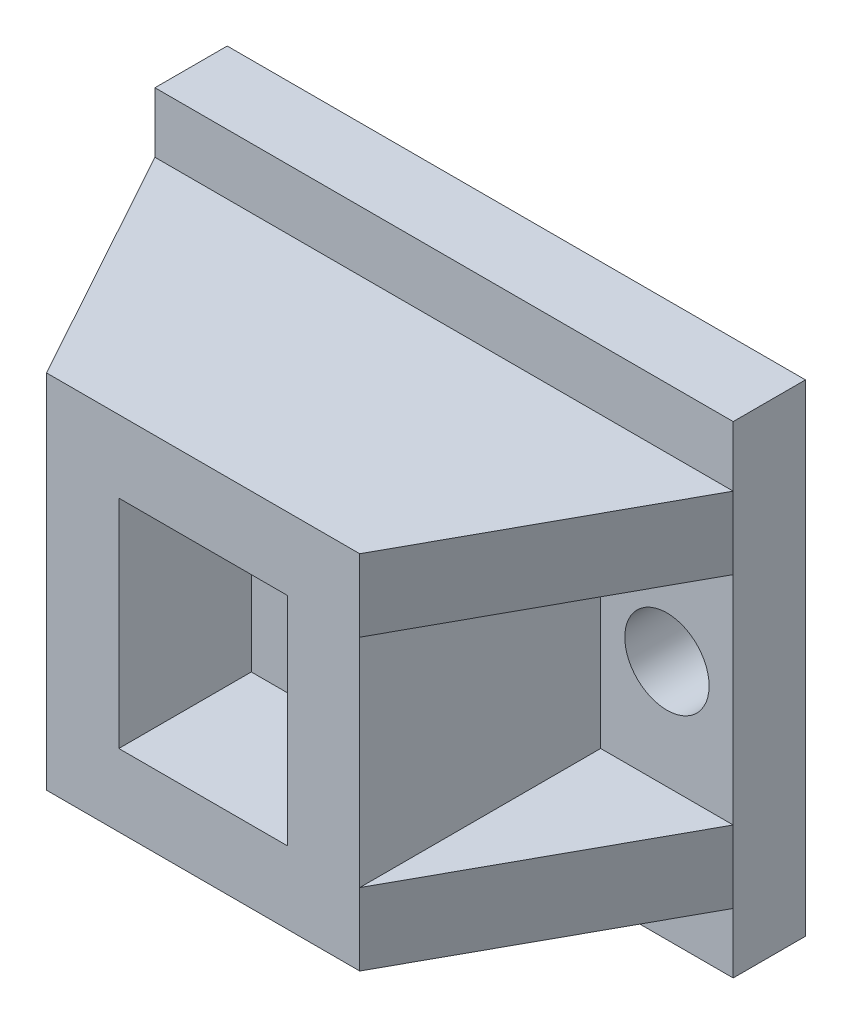
ISO-10303-21;
HEADER;
FILE_DESCRIPTION(('STEP AP214'),'2;1');
FILE_NAME('part.step','',(''),(''),'','','');
FILE_SCHEMA(('AUTOMOTIVE_DESIGN { 1 0 10303 214 1 1 1 1 }'));
ENDSEC;
DATA;
#1=APPLICATION_CONTEXT('core data for automotive mechanical design processes');
#2=APPLICATION_PROTOCOL_DEFINITION('international standard','automotive_design',2000,#1);
#3=PRODUCT_CONTEXT('',#1,'mechanical');
#4=PRODUCT('Part','Part','',(#3));
#5=PRODUCT_RELATED_PRODUCT_CATEGORY('part','',(#4));
#6=PRODUCT_DEFINITION_FORMATION('','',#4);
#7=PRODUCT_DEFINITION_CONTEXT('part definition',#1,'design');
#8=PRODUCT_DEFINITION('design','',#6,#7);
#9=PRODUCT_DEFINITION_SHAPE('','',#8);
#10=(LENGTH_UNIT() NAMED_UNIT(*) SI_UNIT(.MILLI.,.METRE.));
#11=(NAMED_UNIT(*) PLANE_ANGLE_UNIT() SI_UNIT($,.RADIAN.));
#12=(NAMED_UNIT(*) SI_UNIT($,.STERADIAN.) SOLID_ANGLE_UNIT());
#13=UNCERTAINTY_MEASURE_WITH_UNIT(LENGTH_MEASURE(1.E-05),#10,'distance_accuracy_value','');
#14=(GEOMETRIC_REPRESENTATION_CONTEXT(3) GLOBAL_UNCERTAINTY_ASSIGNED_CONTEXT((#13)) GLOBAL_UNIT_ASSIGNED_CONTEXT((#10,
#11,#12)) REPRESENTATION_CONTEXT('',''));
#15=CARTESIAN_POINT('',(0.,0.,0.));
#16=DIRECTION('',(0.,0.,1.));
#17=DIRECTION('',(1.,0.,0.));
#18=AXIS2_PLACEMENT_3D('',#15,#16,#17);
#19=CARTESIAN_POINT('',(0.,0.,3.));
#20=DIRECTION('',(0.,0.,1.));
#21=DIRECTION('',(1.,0.,0.));
#22=AXIS2_PLACEMENT_3D('',#19,#20,#21);
#23=PLANE('',#22);
#24=CARTESIAN_POINT('',(9.25,0.,3.));
#25=DIRECTION('',(0.,0.,1.));
#26=DIRECTION('',(1.,0.,0.));
#27=AXIS2_PLACEMENT_3D('',#24,#25,#26);
#28=CIRCLE('',#27,1.75);
#29=CARTESIAN_POINT('',(11.,0.,3.));
#30=VERTEX_POINT('',#29);
#31=EDGE_CURVE('E273',#30,#30,#28,.T.);
#32=ORIENTED_EDGE('',*,*,#31,.F.);
#33=EDGE_LOOP('',(#32));
#34=FACE_BOUND('',#33,.T.);
#35=DIRECTION('',(0.,-1.,0.));
#36=VECTOR('',#35,1.);
#37=CARTESIAN_POINT('',(12.,0.,3.));
#38=LINE('',#37,#36);
#39=CARTESIAN_POINT('',(12.,4.5,3.));
#40=VERTEX_POINT('',#39);
#41=CARTESIAN_POINT('',(12.,-4.5,3.));
#42=VERTEX_POINT('',#41);
#43=EDGE_CURVE('E285',#40,#42,#38,.T.);
#44=ORIENTED_EDGE('',*,*,#43,.F.);
#45=DIRECTION('',(-1.,0.,0.));
#46=VECTOR('',#45,1.);
#47=CARTESIAN_POINT('',(0.,4.5,3.));
#48=LINE('',#47,#46);
#49=CARTESIAN_POINT('',(6.5,4.5,3.));
#50=VERTEX_POINT('',#49);
#51=EDGE_CURVE('E197',#40,#50,#48,.T.);
#52=ORIENTED_EDGE('',*,*,#51,.T.);
#53=DIRECTION('',(0.,-1.,0.));
#54=VECTOR('',#53,1.);
#55=CARTESIAN_POINT('',(6.5,0.,3.));
#56=LINE('',#55,#54);
#57=CARTESIAN_POINT('',(6.5,-4.5,3.));
#58=VERTEX_POINT('',#57);
#59=EDGE_CURVE('E300',#50,#58,#56,.T.);
#60=ORIENTED_EDGE('',*,*,#59,.T.);
#61=DIRECTION('',(1.,0.,0.));
#62=VECTOR('',#61,1.);
#63=CARTESIAN_POINT('',(0.,-4.5,3.));
#64=LINE('',#63,#62);
#65=EDGE_CURVE('E211',#58,#42,#64,.T.);
#66=ORIENTED_EDGE('',*,*,#65,.T.);
#67=EDGE_LOOP('',(#44,#52,#60,#66));
#68=FACE_BOUND('',#67,.T.);
#69=ADVANCED_FACE('F39',(#34,#68),#23,.T.);
#70=CARTESIAN_POINT('',(6.5,0.,13.));
#71=DIRECTION('',(1.,0.,0.));
#72=DIRECTION('',(0.,1.,0.));
#73=AXIS2_PLACEMENT_3D('',#70,#71,#72);
#74=PLANE('',#73);
#75=ORIENTED_EDGE('',*,*,#59,.F.);
#76=DIRECTION('',(0.,0.,1.));
#77=VECTOR('',#76,1.);
#78=CARTESIAN_POINT('',(6.5,4.5,13.));
#79=LINE('',#78,#77);
#80=CARTESIAN_POINT('',(6.5,4.5,13.));
#81=VERTEX_POINT('',#80);
#82=EDGE_CURVE('E192',#50,#81,#79,.T.);
#83=ORIENTED_EDGE('',*,*,#82,.T.);
#84=DIRECTION('',(0.,-1.,0.));
#85=VECTOR('',#84,1.);
#86=CARTESIAN_POINT('',(6.5,0.,13.));
#87=LINE('',#86,#85);
#88=CARTESIAN_POINT('',(6.5,-4.5,13.));
#89=VERTEX_POINT('',#88);
#90=EDGE_CURVE('E260',#81,#89,#87,.T.);
#91=ORIENTED_EDGE('',*,*,#90,.T.);
#92=DIRECTION('',(0.,0.,-1.));
#93=VECTOR('',#92,1.);
#94=CARTESIAN_POINT('',(6.5,-4.5,13.));
#95=LINE('',#94,#93);
#96=EDGE_CURVE('E206',#89,#58,#95,.T.);
#97=ORIENTED_EDGE('',*,*,#96,.T.);
#98=EDGE_LOOP('',(#75,#83,#91,#97));
#99=FACE_BOUND('',#98,.T.);
#100=ADVANCED_FACE('F394',(#99),#74,.T.);
#101=DIRECTION('',(1.,0.,0.));
#102=VECTOR('',#101,1.);
#103=CARTESIAN_POINT('',(0.,7.5,3.));
#104=LINE('',#103,#102);
#105=CARTESIAN_POINT('',(-12.,7.5,3.));
#106=VERTEX_POINT('',#105);
#107=CARTESIAN_POINT('',(12.,7.5,3.));
#108=VERTEX_POINT('',#107);
#109=EDGE_CURVE('E298',#106,#108,#104,.T.);
#110=ORIENTED_EDGE('',*,*,#109,.T.);
#111=CARTESIAN_POINT('',(12.,10.,3.));
#112=VERTEX_POINT('',#111);
#113=EDGE_CURVE('E281',#112,#108,#38,.T.);
#114=ORIENTED_EDGE('',*,*,#113,.F.);
#115=DIRECTION('',(1.,0.,0.));
#116=VECTOR('',#115,1.);
#117=CARTESIAN_POINT('',(0.,10.,3.));
#118=LINE('',#117,#116);
#119=CARTESIAN_POINT('',(-12.,10.,3.));
#120=VERTEX_POINT('',#119);
#121=EDGE_CURVE('E284',#120,#112,#118,.T.);
#122=ORIENTED_EDGE('',*,*,#121,.F.);
#123=DIRECTION('',(0.,-1.,0.));
#124=VECTOR('',#123,1.);
#125=CARTESIAN_POINT('',(-12.,0.,3.));
#126=LINE('',#125,#124);
#127=EDGE_CURVE('E289',#120,#106,#126,.T.);
#128=ORIENTED_EDGE('',*,*,#127,.T.);
#129=EDGE_LOOP('',(#110,#114,#122,#128));
#130=FACE_BOUND('',#129,.T.);
#131=ADVANCED_FACE('F377',(#130),#23,.T.);
#132=CARTESIAN_POINT('',(-6.5,0.,13.));
#133=DIRECTION('',(1.,0.,0.));
#134=DIRECTION('',(0.,1.,0.));
#135=AXIS2_PLACEMENT_3D('',#132,#133,#134);
#136=PLANE('',#135);
#137=DIRECTION('',(0.,0.,1.));
#138=VECTOR('',#137,1.);
#139=CARTESIAN_POINT('',(-6.5,4.5,13.));
#140=LINE('',#139,#138);
#141=CARTESIAN_POINT('',(-6.5,4.5,3.));
#142=VERTEX_POINT('',#141);
#143=CARTESIAN_POINT('',(-6.5,4.5,13.));
#144=VERTEX_POINT('',#143);
#145=EDGE_CURVE('E221',#142,#144,#140,.T.);
#146=ORIENTED_EDGE('',*,*,#145,.F.);
#147=DIRECTION('',(0.,-1.,0.));
#148=VECTOR('',#147,1.);
#149=CARTESIAN_POINT('',(-6.5,0.,3.));
#150=LINE('',#149,#148);
#151=CARTESIAN_POINT('',(-6.5,-4.5,3.));
#152=VERTEX_POINT('',#151);
#153=EDGE_CURVE('E296',#142,#152,#150,.T.);
#154=ORIENTED_EDGE('',*,*,#153,.T.);
#155=DIRECTION('',(0.,0.,-1.));
#156=VECTOR('',#155,1.);
#157=CARTESIAN_POINT('',(-6.5,-4.5,13.));
#158=LINE('',#157,#156);
#159=CARTESIAN_POINT('',(-6.5,-4.5,13.));
#160=VERTEX_POINT('',#159);
#161=EDGE_CURVE('E235',#160,#152,#158,.T.);
#162=ORIENTED_EDGE('',*,*,#161,.F.);
#163=DIRECTION('',(0.,-1.,0.));
#164=VECTOR('',#163,1.);
#165=CARTESIAN_POINT('',(-6.5,0.,13.));
#166=LINE('',#165,#164);
#167=EDGE_CURVE('E253',#144,#160,#166,.T.);
#168=ORIENTED_EDGE('',*,*,#167,.F.);
#169=EDGE_LOOP('',(#146,#154,#162,#168));
#170=FACE_BOUND('',#169,.T.);
#171=ADVANCED_FACE('F370',(#170),#136,.F.);
#172=CARTESIAN_POINT('',(-9.25,0.,3.));
#173=DIRECTION('',(0.,0.,1.));
#174=DIRECTION('',(1.,0.,0.));
#175=AXIS2_PLACEMENT_3D('',#172,#173,#174);
#176=CIRCLE('',#175,1.75);
#177=CARTESIAN_POINT('',(-7.5,0.,3.));
#178=VERTEX_POINT('',#177);
#179=EDGE_CURVE('E276',#178,#178,#176,.T.);
#180=ORIENTED_EDGE('',*,*,#179,.F.);
#181=EDGE_LOOP('',(#180));
#182=FACE_BOUND('',#181,.T.);
#183=ORIENTED_EDGE('',*,*,#153,.F.);
#184=DIRECTION('',(-1.,0.,0.));
#185=VECTOR('',#184,1.);
#186=CARTESIAN_POINT('',(0.,4.5,3.));
#187=LINE('',#186,#185);
#188=CARTESIAN_POINT('',(-12.,4.5,3.));
#189=VERTEX_POINT('',#188);
#190=EDGE_CURVE('E224',#142,#189,#187,.T.);
#191=ORIENTED_EDGE('',*,*,#190,.T.);
#192=CARTESIAN_POINT('',(-12.,-4.5,3.));
#193=VERTEX_POINT('',#192);
#194=EDGE_CURVE('E293',#189,#193,#126,.T.);
#195=ORIENTED_EDGE('',*,*,#194,.T.);
#196=DIRECTION('',(1.,0.,0.));
#197=VECTOR('',#196,1.);
#198=CARTESIAN_POINT('',(0.,-4.5,3.));
#199=LINE('',#198,#197);
#200=EDGE_CURVE('E240',#193,#152,#199,.T.);
#201=ORIENTED_EDGE('',*,*,#200,.T.);
#202=EDGE_LOOP('',(#183,#191,#195,#201));
#203=FACE_BOUND('',#202,.T.);
#204=ADVANCED_FACE('F354',(#182,#203),#23,.T.);
#205=CARTESIAN_POINT('',(12.,0.,3.));
#206=DIRECTION('',(1.,0.,0.));
#207=DIRECTION('',(0.,0.,-1.));
#208=AXIS2_PLACEMENT_3D('',#205,#206,#207);
#209=PLANE('',#208);
#210=ORIENTED_EDGE('',*,*,#113,.T.);
#211=DIRECTION('',(0.,-1.,0.));
#212=VECTOR('',#211,1.);
#213=CARTESIAN_POINT('',(12.,0.,3.));
#214=LINE('',#213,#212);
#215=EDGE_CURVE('E199',#108,#40,#214,.T.);
#216=ORIENTED_EDGE('',*,*,#215,.T.);
#217=ORIENTED_EDGE('',*,*,#43,.T.);
#218=DIRECTION('',(0.,-1.,0.));
#219=VECTOR('',#218,1.);
#220=CARTESIAN_POINT('',(12.,0.,3.));
#221=LINE('',#220,#219);
#222=CARTESIAN_POINT('',(12.,-7.5,3.));
#223=VERTEX_POINT('',#222);
#224=EDGE_CURVE('E214',#223,#42,#221,.F.);
#225=ORIENTED_EDGE('',*,*,#224,.F.);
#226=CARTESIAN_POINT('',(12.,-10.,3.));
#227=VERTEX_POINT('',#226);
#228=EDGE_CURVE('E280',#223,#227,#38,.T.);
#229=ORIENTED_EDGE('',*,*,#228,.T.);
#230=DIRECTION('',(0.,0.,-1.));
#231=VECTOR('',#230,1.);
#232=CARTESIAN_POINT('',(12.,-10.,3.));
#233=LINE('',#232,#231);
#234=CARTESIAN_POINT('',(12.,-10.,0.));
#235=VERTEX_POINT('',#234);
#236=EDGE_CURVE('E304',#227,#235,#233,.T.);
#237=ORIENTED_EDGE('',*,*,#236,.T.);
#238=DIRECTION('',(0.,-1.,0.));
#239=VECTOR('',#238,1.);
#240=CARTESIAN_POINT('',(12.,0.,0.));
#241=LINE('',#240,#239);
#242=CARTESIAN_POINT('',(12.,10.,0.));
#243=VERTEX_POINT('',#242);
#244=EDGE_CURVE('E310',#243,#235,#241,.T.);
#245=ORIENTED_EDGE('',*,*,#244,.F.);
#246=DIRECTION('',(0.,0.,-1.));
#247=VECTOR('',#246,1.);
#248=CARTESIAN_POINT('',(12.,10.,3.));
#249=LINE('',#248,#247);
#250=EDGE_CURVE('E11',#112,#243,#249,.T.);
#251=ORIENTED_EDGE('',*,*,#250,.F.);
#252=EDGE_LOOP('',(#210,#216,#217,#225,#229,#237,#245,#251));
#253=FACE_BOUND('',#252,.T.);
#254=ADVANCED_FACE('F340',(#253),#209,.T.);
#255=CARTESIAN_POINT('',(0.,10.,3.));
#256=DIRECTION('',(0.,1.,0.));
#257=DIRECTION('',(0.,0.,1.));
#258=AXIS2_PLACEMENT_3D('',#255,#256,#257);
#259=PLANE('',#258);
#260=DIRECTION('',(1.,0.,0.));
#261=VECTOR('',#260,1.);
#262=CARTESIAN_POINT('',(0.,10.,0.));
#263=LINE('',#262,#261);
#264=CARTESIAN_POINT('',(-12.,10.,0.));
#265=VERTEX_POINT('',#264);
#266=EDGE_CURVE('E312',#265,#243,#263,.T.);
#267=ORIENTED_EDGE('',*,*,#266,.F.);
#268=DIRECTION('',(0.,0.,-1.));
#269=VECTOR('',#268,1.);
#270=CARTESIAN_POINT('',(-12.,10.,3.));
#271=LINE('',#270,#269);
#272=EDGE_CURVE('E47',#120,#265,#271,.T.);
#273=ORIENTED_EDGE('',*,*,#272,.F.);
#274=ORIENTED_EDGE('',*,*,#121,.T.);
#275=ORIENTED_EDGE('',*,*,#250,.T.);
#276=EDGE_LOOP('',(#267,#273,#274,#275));
#277=FACE_BOUND('',#276,.T.);
#278=ADVANCED_FACE('F336',(#277),#259,.T.);
#279=CARTESIAN_POINT('',(-12.,0.,3.));
#280=DIRECTION('',(1.,0.,0.));
#281=DIRECTION('',(0.,0.,-1.));
#282=AXIS2_PLACEMENT_3D('',#279,#280,#281);
#283=PLANE('',#282);
#284=DIRECTION('',(0.,-1.,0.));
#285=VECTOR('',#284,1.);
#286=CARTESIAN_POINT('',(-12.,0.,0.));
#287=LINE('',#286,#285);
#288=CARTESIAN_POINT('',(-12.,-10.,0.));
#289=VERTEX_POINT('',#288);
#290=EDGE_CURVE('E315',#265,#289,#287,.T.);
#291=ORIENTED_EDGE('',*,*,#290,.T.);
#292=DIRECTION('',(0.,0.,-1.));
#293=VECTOR('',#292,1.);
#294=CARTESIAN_POINT('',(-12.,-10.,3.));
#295=LINE('',#294,#293);
#296=CARTESIAN_POINT('',(-12.,-10.,3.));
#297=VERTEX_POINT('',#296);
#298=EDGE_CURVE('E321',#297,#289,#295,.T.);
#299=ORIENTED_EDGE('',*,*,#298,.F.);
#300=CARTESIAN_POINT('',(-12.,-7.5,3.));
#301=VERTEX_POINT('',#300);
#302=EDGE_CURVE('E288',#301,#297,#126,.T.);
#303=ORIENTED_EDGE('',*,*,#302,.F.);
#304=DIRECTION('',(0.,-1.,0.));
#305=VECTOR('',#304,1.);
#306=CARTESIAN_POINT('',(-12.,0.,3.));
#307=LINE('',#306,#305);
#308=EDGE_CURVE('E243',#193,#301,#307,.T.);
#309=ORIENTED_EDGE('',*,*,#308,.F.);
#310=ORIENTED_EDGE('',*,*,#194,.F.);
#311=DIRECTION('',(0.,1.,0.));
#312=VECTOR('',#311,1.);
#313=CARTESIAN_POINT('',(-12.,0.,3.));
#314=LINE('',#313,#312);
#315=EDGE_CURVE('E227',#106,#189,#314,.F.);
#316=ORIENTED_EDGE('',*,*,#315,.F.);
#317=ORIENTED_EDGE('',*,*,#127,.F.);
#318=ORIENTED_EDGE('',*,*,#272,.T.);
#319=EDGE_LOOP('',(#291,#299,#303,#309,#310,#316,#317,#318));
#320=FACE_BOUND('',#319,.T.);
#321=ADVANCED_FACE('F326',(#320),#283,.F.);
#322=CARTESIAN_POINT('',(0.,-10.,3.));
#323=DIRECTION('',(0.,1.,0.));
#324=DIRECTION('',(0.,0.,1.));
#325=AXIS2_PLACEMENT_3D('',#322,#323,#324);
#326=PLANE('',#325);
#327=DIRECTION('',(1.,0.,0.));
#328=VECTOR('',#327,1.);
#329=CARTESIAN_POINT('',(0.,-10.,0.));
#330=LINE('',#329,#328);
#331=EDGE_CURVE('E277',#289,#235,#330,.T.);
#332=ORIENTED_EDGE('',*,*,#331,.T.);
#333=ORIENTED_EDGE('',*,*,#236,.F.);
#334=DIRECTION('',(1.,0.,0.));
#335=VECTOR('',#334,1.);
#336=CARTESIAN_POINT('',(0.,-10.,3.));
#337=LINE('',#336,#335);
#338=EDGE_CURVE('E292',#297,#227,#337,.T.);
#339=ORIENTED_EDGE('',*,*,#338,.F.);
#340=ORIENTED_EDGE('',*,*,#298,.T.);
#341=EDGE_LOOP('',(#332,#333,#339,#340));
#342=FACE_BOUND('',#341,.T.);
#343=ADVANCED_FACE('F346',(#342),#326,.F.);
#344=CARTESIAN_POINT('',(-9.25,0.,3.));
#345=DIRECTION('',(0.,0.,-1.));
#346=DIRECTION('',(-1.,0.,0.));
#347=AXIS2_PLACEMENT_3D('',#344,#345,#346);
#348=CYLINDRICAL_SURFACE('',#347,1.75);
#349=ORIENTED_EDGE('',*,*,#179,.T.);
#350=EDGE_LOOP('',(#349));
#351=FACE_BOUND('',#350,.T.);
#352=CARTESIAN_POINT('',(-9.25,0.,0.));
#353=DIRECTION('',(0.,0.,1.));
#354=DIRECTION('',(1.,0.,0.));
#355=AXIS2_PLACEMENT_3D('',#352,#353,#354);
#356=CIRCLE('',#355,1.75);
#357=CARTESIAN_POINT('',(-7.5,0.,0.));
#358=VERTEX_POINT('',#357);
#359=EDGE_CURVE('E307',#358,#358,#356,.T.);
#360=ORIENTED_EDGE('',*,*,#359,.F.);
#361=EDGE_LOOP('',(#360));
#362=FACE_BOUND('',#361,.T.);
#363=ADVANCED_FACE('F415',(#351,#362),#348,.F.);
#364=CARTESIAN_POINT('',(9.25,0.,3.));
#365=DIRECTION('',(0.,0.,-1.));
#366=DIRECTION('',(-1.,0.,0.));
#367=AXIS2_PLACEMENT_3D('',#364,#365,#366);
#368=CYLINDRICAL_SURFACE('',#367,1.75);
#369=ORIENTED_EDGE('',*,*,#31,.T.);
#370=EDGE_LOOP('',(#369));
#371=FACE_BOUND('',#370,.T.);
#372=CARTESIAN_POINT('',(9.25,0.,0.));
#373=DIRECTION('',(0.,0.,1.));
#374=DIRECTION('',(1.,0.,0.));
#375=AXIS2_PLACEMENT_3D('',#372,#373,#374);
#376=CIRCLE('',#375,1.75);
#377=CARTESIAN_POINT('',(11.,0.,0.));
#378=VERTEX_POINT('',#377);
#379=EDGE_CURVE('E272',#378,#378,#376,.T.);
#380=ORIENTED_EDGE('',*,*,#379,.F.);
#381=EDGE_LOOP('',(#380));
#382=FACE_BOUND('',#381,.T.);
#383=ADVANCED_FACE('F41',(#371,#382),#368,.F.);
#384=ORIENTED_EDGE('',*,*,#228,.F.);
#385=DIRECTION('',(1.,0.,0.));
#386=VECTOR('',#385,1.);
#387=CARTESIAN_POINT('',(0.,-7.5,3.));
#388=LINE('',#387,#386);
#389=EDGE_CURVE('E302',#301,#223,#388,.T.);
#390=ORIENTED_EDGE('',*,*,#389,.F.);
#391=ORIENTED_EDGE('',*,*,#302,.T.);
#392=ORIENTED_EDGE('',*,*,#338,.T.);
#393=EDGE_LOOP('',(#384,#390,#391,#392));
#394=FACE_BOUND('',#393,.T.);
#395=ADVANCED_FACE('F406',(#394),#23,.T.);
#396=CARTESIAN_POINT('',(0.,0.,0.));
#397=DIRECTION('',(0.,0.,1.));
#398=DIRECTION('',(1.,0.,0.));
#399=AXIS2_PLACEMENT_3D('',#396,#397,#398);
#400=PLANE('',#399);
#401=ORIENTED_EDGE('',*,*,#244,.T.);
#402=ORIENTED_EDGE('',*,*,#331,.F.);
#403=ORIENTED_EDGE('',*,*,#290,.F.);
#404=ORIENTED_EDGE('',*,*,#266,.T.);
#405=EDGE_LOOP('',(#401,#402,#403,#404));
#406=FACE_BOUND('',#405,.T.);
#407=ORIENTED_EDGE('',*,*,#379,.T.);
#408=EDGE_LOOP('',(#407));
#409=FACE_BOUND('',#408,.T.);
#410=ORIENTED_EDGE('',*,*,#359,.T.);
#411=EDGE_LOOP('',(#410));
#412=FACE_BOUND('',#411,.T.);
#413=ADVANCED_FACE('F334',(#406,#409,#412),#400,.F.);
#414=CARTESIAN_POINT('',(0.,4.5,13.));
#415=DIRECTION('',(0.,1.,0.));
#416=DIRECTION('',(0.,0.,1.));
#417=AXIS2_PLACEMENT_3D('',#414,#415,#416);
#418=PLANE('',#417);
#419=DIRECTION('',(0.,0.,-1.));
#420=VECTOR('',#419,1.);
#421=CARTESIAN_POINT('',(-3.5,4.5,13.));
#422=LINE('',#421,#420);
#423=CARTESIAN_POINT('',(-3.5,4.5,13.));
#424=VERTEX_POINT('',#423);
#425=CARTESIAN_POINT('',(-3.5,4.5,7.5));
#426=VERTEX_POINT('',#425);
#427=EDGE_CURVE('E176',#424,#426,#422,.T.);
#428=ORIENTED_EDGE('',*,*,#427,.T.);
#429=DIRECTION('',(1.,0.,0.));
#430=VECTOR('',#429,1.);
#431=CARTESIAN_POINT('',(0.,4.5,7.5));
#432=LINE('',#431,#430);
#433=CARTESIAN_POINT('',(3.5,4.5,7.5));
#434=VERTEX_POINT('',#433);
#435=EDGE_CURVE('E54',#426,#434,#432,.T.);
#436=ORIENTED_EDGE('',*,*,#435,.T.);
#437=DIRECTION('',(0.,0.,-1.));
#438=VECTOR('',#437,1.);
#439=CARTESIAN_POINT('',(3.5,4.5,13.));
#440=LINE('',#439,#438);
#441=CARTESIAN_POINT('',(3.5,4.5,13.));
#442=VERTEX_POINT('',#441);
#443=EDGE_CURVE('E270',#442,#434,#440,.T.);
#444=ORIENTED_EDGE('',*,*,#443,.F.);
#445=DIRECTION('',(1.,0.,0.));
#446=VECTOR('',#445,1.);
#447=CARTESIAN_POINT('',(0.,4.5,13.));
#448=LINE('',#447,#446);
#449=EDGE_CURVE('E259',#424,#442,#448,.T.);
#450=ORIENTED_EDGE('',*,*,#449,.F.);
#451=EDGE_LOOP('',(#428,#436,#444,#450));
#452=FACE_BOUND('',#451,.T.);
#453=ADVANCED_FACE('F413',(#452),#418,.F.);
#454=CARTESIAN_POINT('',(3.5,0.,13.));
#455=DIRECTION('',(1.,0.,0.));
#456=DIRECTION('',(0.,1.,0.));
#457=AXIS2_PLACEMENT_3D('',#454,#455,#456);
#458=PLANE('',#457);
#459=ORIENTED_EDGE('',*,*,#443,.T.);
#460=DIRECTION('',(0.,-1.,0.));
#461=VECTOR('',#460,1.);
#462=CARTESIAN_POINT('',(3.5,0.,7.5));
#463=LINE('',#462,#461);
#464=CARTESIAN_POINT('',(3.5,-4.5,7.5));
#465=VERTEX_POINT('',#464);
#466=EDGE_CURVE('E61',#434,#465,#463,.T.);
#467=ORIENTED_EDGE('',*,*,#466,.T.);
#468=DIRECTION('',(0.,0.,-1.));
#469=VECTOR('',#468,1.);
#470=CARTESIAN_POINT('',(3.5,-4.5,13.));
#471=LINE('',#470,#469);
#472=CARTESIAN_POINT('',(3.5,-4.5,13.));
#473=VERTEX_POINT('',#472);
#474=EDGE_CURVE('E175',#473,#465,#471,.T.);
#475=ORIENTED_EDGE('',*,*,#474,.F.);
#476=DIRECTION('',(0.,-1.,0.));
#477=VECTOR('',#476,1.);
#478=CARTESIAN_POINT('',(3.5,0.,13.));
#479=LINE('',#478,#477);
#480=EDGE_CURVE('E263',#442,#473,#479,.T.);
#481=ORIENTED_EDGE('',*,*,#480,.F.);
#482=EDGE_LOOP('',(#459,#467,#475,#481));
#483=FACE_BOUND('',#482,.T.);
#484=ADVANCED_FACE('F444',(#483),#458,.F.);
#485=CARTESIAN_POINT('',(0.,-4.5,13.));
#486=DIRECTION('',(0.,1.,0.));
#487=DIRECTION('',(-1.,0.,0.));
#488=AXIS2_PLACEMENT_3D('',#485,#486,#487);
#489=PLANE('',#488);
#490=DIRECTION('',(1.,0.,0.));
#491=VECTOR('',#490,1.);
#492=CARTESIAN_POINT('',(0.,-4.5,7.5));
#493=LINE('',#492,#491);
#494=CARTESIAN_POINT('',(-3.5,-4.5,7.5));
#495=VERTEX_POINT('',#494);
#496=EDGE_CURVE('E179',#495,#465,#493,.T.);
#497=ORIENTED_EDGE('',*,*,#496,.F.);
#498=DIRECTION('',(0.,0.,-1.));
#499=VECTOR('',#498,1.);
#500=CARTESIAN_POINT('',(-3.5,-4.5,13.));
#501=LINE('',#500,#499);
#502=CARTESIAN_POINT('',(-3.5,-4.5,13.));
#503=VERTEX_POINT('',#502);
#504=EDGE_CURVE('E165',#503,#495,#501,.T.);
#505=ORIENTED_EDGE('',*,*,#504,.F.);
#506=DIRECTION('',(1.,0.,0.));
#507=VECTOR('',#506,1.);
#508=CARTESIAN_POINT('',(0.,-4.5,13.));
#509=LINE('',#508,#507);
#510=EDGE_CURVE('E265',#503,#473,#509,.T.);
#511=ORIENTED_EDGE('',*,*,#510,.T.);
#512=ORIENTED_EDGE('',*,*,#474,.T.);
#513=EDGE_LOOP('',(#497,#505,#511,#512));
#514=FACE_BOUND('',#513,.T.);
#515=ADVANCED_FACE('F180',(#514),#489,.T.);
#516=CARTESIAN_POINT('',(0.,7.5,13.));
#517=DIRECTION('',(0.,1.,0.));
#518=DIRECTION('',(0.,0.,1.));
#519=AXIS2_PLACEMENT_3D('',#516,#517,#518);
#520=PLANE('',#519);
#521=DIRECTION('',(1.,0.,0.));
#522=VECTOR('',#521,1.);
#523=CARTESIAN_POINT('',(0.,7.5,13.));
#524=LINE('',#523,#522);
#525=CARTESIAN_POINT('',(-6.5,7.5,13.));
#526=VERTEX_POINT('',#525);
#527=CARTESIAN_POINT('',(6.5,7.5,13.));
#528=VERTEX_POINT('',#527);
#529=EDGE_CURVE('E246',#526,#528,#524,.T.);
#530=ORIENTED_EDGE('',*,*,#529,.T.);
#531=DIRECTION('',(0.481918749772156,0.,-0.876215908676647));
#532=VECTOR('',#531,1.);
#533=CARTESIAN_POINT('',(6.5,7.5,13.));
#534=LINE('',#533,#532);
#535=EDGE_CURVE('E189',#528,#108,#534,.T.);
#536=ORIENTED_EDGE('',*,*,#535,.T.);
#537=ORIENTED_EDGE('',*,*,#109,.F.);
#538=DIRECTION('',(-0.481918749772156,0.,-0.876215908676647));
#539=VECTOR('',#538,1.);
#540=CARTESIAN_POINT('',(-6.5,7.5,13.));
#541=LINE('',#540,#539);
#542=EDGE_CURVE('E218',#526,#106,#541,.T.);
#543=ORIENTED_EDGE('',*,*,#542,.F.);
#544=EDGE_LOOP('',(#530,#536,#537,#543));
#545=FACE_BOUND('',#544,.T.);
#546=ADVANCED_FACE('F385',(#545),#520,.T.);
#547=CARTESIAN_POINT('',(0.,-7.5,13.));
#548=DIRECTION('',(0.,1.,0.));
#549=DIRECTION('',(0.,0.,1.));
#550=AXIS2_PLACEMENT_3D('',#547,#548,#549);
#551=PLANE('',#550);
#552=ORIENTED_EDGE('',*,*,#389,.T.);
#553=DIRECTION('',(0.481918749772156,0.,-0.876215908676647));
#554=VECTOR('',#553,1.);
#555=CARTESIAN_POINT('',(6.5,-7.5,13.));
#556=LINE('',#555,#554);
#557=CARTESIAN_POINT('',(6.5,-7.5,13.));
#558=VERTEX_POINT('',#557);
#559=EDGE_CURVE('E203',#558,#223,#556,.T.);
#560=ORIENTED_EDGE('',*,*,#559,.F.);
#561=DIRECTION('',(1.,0.,0.));
#562=VECTOR('',#561,1.);
#563=CARTESIAN_POINT('',(0.,-7.5,13.));
#564=LINE('',#563,#562);
#565=CARTESIAN_POINT('',(-6.5,-7.5,13.));
#566=VERTEX_POINT('',#565);
#567=EDGE_CURVE('E252',#566,#558,#564,.T.);
#568=ORIENTED_EDGE('',*,*,#567,.F.);
#569=DIRECTION('',(-0.481918749772156,0.,-0.876215908676647));
#570=VECTOR('',#569,1.);
#571=CARTESIAN_POINT('',(-6.5,-7.5,13.));
#572=LINE('',#571,#570);
#573=EDGE_CURVE('E232',#566,#301,#572,.T.);
#574=ORIENTED_EDGE('',*,*,#573,.T.);
#575=EDGE_LOOP('',(#552,#560,#568,#574));
#576=FACE_BOUND('',#575,.T.);
#577=ADVANCED_FACE('F405',(#576),#551,.F.);
#578=CARTESIAN_POINT('',(-3.5,0.,13.));
#579=DIRECTION('',(1.,0.,0.));
#580=DIRECTION('',(0.,1.,0.));
#581=AXIS2_PLACEMENT_3D('',#578,#579,#580);
#582=PLANE('',#581);
#583=DIRECTION('',(0.,-1.,0.));
#584=VECTOR('',#583,1.);
#585=CARTESIAN_POINT('',(-3.5,0.,7.5));
#586=LINE('',#585,#584);
#587=EDGE_CURVE('E169',#426,#495,#586,.T.);
#588=ORIENTED_EDGE('',*,*,#587,.F.);
#589=ORIENTED_EDGE('',*,*,#427,.F.);
#590=DIRECTION('',(0.,-1.,0.));
#591=VECTOR('',#590,1.);
#592=CARTESIAN_POINT('',(-3.5,0.,13.));
#593=LINE('',#592,#591);
#594=EDGE_CURVE('E171',#424,#503,#593,.T.);
#595=ORIENTED_EDGE('',*,*,#594,.T.);
#596=ORIENTED_EDGE('',*,*,#504,.T.);
#597=EDGE_LOOP('',(#588,#589,#595,#596));
#598=FACE_BOUND('',#597,.T.);
#599=ADVANCED_FACE('F167',(#598),#582,.T.);
#600=CARTESIAN_POINT('',(0.,0.,13.));
#601=DIRECTION('',(0.,0.,1.));
#602=DIRECTION('',(1.,0.,0.));
#603=AXIS2_PLACEMENT_3D('',#600,#601,#602);
#604=PLANE('',#603);
#605=ORIENTED_EDGE('',*,*,#449,.T.);
#606=ORIENTED_EDGE('',*,*,#480,.T.);
#607=ORIENTED_EDGE('',*,*,#510,.F.);
#608=ORIENTED_EDGE('',*,*,#594,.F.);
#609=EDGE_LOOP('',(#605,#606,#607,#608));
#610=FACE_BOUND('',#609,.T.);
#611=ORIENTED_EDGE('',*,*,#90,.F.);
#612=EDGE_CURVE('E256',#528,#81,#87,.T.);
#613=ORIENTED_EDGE('',*,*,#612,.F.);
#614=ORIENTED_EDGE('',*,*,#529,.F.);
#615=EDGE_CURVE('E249',#526,#144,#166,.T.);
#616=ORIENTED_EDGE('',*,*,#615,.T.);
#617=ORIENTED_EDGE('',*,*,#167,.T.);
#618=EDGE_CURVE('E248',#160,#566,#166,.T.);
#619=ORIENTED_EDGE('',*,*,#618,.T.);
#620=ORIENTED_EDGE('',*,*,#567,.T.);
#621=EDGE_CURVE('E255',#89,#558,#87,.T.);
#622=ORIENTED_EDGE('',*,*,#621,.F.);
#623=EDGE_LOOP('',(#611,#613,#614,#616,#617,#619,#620,#622));
#624=FACE_BOUND('',#623,.T.);
#625=ADVANCED_FACE('F366',(#610,#624),#604,.T.);
#626=CARTESIAN_POINT('',(-6.5,-7.5,13.));
#627=DIRECTION('',(-0.876215908676647,0.,0.481918749772156));
#628=DIRECTION('',(-0.481918749772156,0.,-0.876215908676647));
#629=AXIS2_PLACEMENT_3D('',#626,#627,#628);
#630=PLANE('',#629);
#631=DIRECTION('',(-0.481918749772156,0.,-0.876215908676647));
#632=VECTOR('',#631,1.);
#633=CARTESIAN_POINT('',(-6.5,-4.5,13.));
#634=LINE('',#633,#632);
#635=EDGE_CURVE('E231',#160,#193,#634,.T.);
#636=ORIENTED_EDGE('',*,*,#635,.T.);
#637=ORIENTED_EDGE('',*,*,#308,.T.);
#638=ORIENTED_EDGE('',*,*,#573,.F.);
#639=ORIENTED_EDGE('',*,*,#618,.F.);
#640=EDGE_LOOP('',(#636,#637,#638,#639));
#641=FACE_BOUND('',#640,.T.);
#642=ADVANCED_FACE('F361',(#641),#630,.T.);
#643=CARTESIAN_POINT('',(0.,-4.5,6.5));
#644=DIRECTION('',(0.,-1.,0.));
#645=DIRECTION('',(0.,0.,-1.));
#646=AXIS2_PLACEMENT_3D('',#643,#644,#645);
#647=PLANE('',#646);
#648=ORIENTED_EDGE('',*,*,#200,.F.);
#649=ORIENTED_EDGE('',*,*,#635,.F.);
#650=ORIENTED_EDGE('',*,*,#161,.T.);
#651=EDGE_LOOP('',(#648,#649,#650));
#652=FACE_BOUND('',#651,.T.);
#653=ADVANCED_FACE('F357',(#652),#647,.F.);
#654=CARTESIAN_POINT('',(-6.5,7.5,13.));
#655=DIRECTION('',(0.876215908676647,0.,-0.481918749772156));
#656=DIRECTION('',(-0.481918749772156,0.,-0.876215908676647));
#657=AXIS2_PLACEMENT_3D('',#654,#655,#656);
#658=PLANE('',#657);
#659=ORIENTED_EDGE('',*,*,#542,.T.);
#660=ORIENTED_EDGE('',*,*,#315,.T.);
#661=DIRECTION('',(-0.481918749772156,0.,-0.876215908676647));
#662=VECTOR('',#661,1.);
#663=CARTESIAN_POINT('',(-6.5,4.5,13.));
#664=LINE('',#663,#662);
#665=EDGE_CURVE('E217',#144,#189,#664,.T.);
#666=ORIENTED_EDGE('',*,*,#665,.F.);
#667=ORIENTED_EDGE('',*,*,#615,.F.);
#668=EDGE_LOOP('',(#659,#660,#666,#667));
#669=FACE_BOUND('',#668,.T.);
#670=ADVANCED_FACE('F374',(#669),#658,.F.);
#671=CARTESIAN_POINT('',(0.,4.5,6.5));
#672=DIRECTION('',(0.,1.,0.));
#673=DIRECTION('',(0.,0.,1.));
#674=AXIS2_PLACEMENT_3D('',#671,#672,#673);
#675=PLANE('',#674);
#676=ORIENTED_EDGE('',*,*,#190,.F.);
#677=ORIENTED_EDGE('',*,*,#145,.T.);
#678=ORIENTED_EDGE('',*,*,#665,.T.);
#679=EDGE_LOOP('',(#676,#677,#678));
#680=FACE_BOUND('',#679,.T.);
#681=ADVANCED_FACE('F372',(#680),#675,.F.);
#682=CARTESIAN_POINT('',(6.5,-7.5,13.));
#683=DIRECTION('',(-0.876215908676647,0.,-0.481918749772156));
#684=DIRECTION('',(0.481918749772156,0.,-0.876215908676647));
#685=AXIS2_PLACEMENT_3D('',#682,#683,#684);
#686=PLANE('',#685);
#687=ORIENTED_EDGE('',*,*,#559,.T.);
#688=ORIENTED_EDGE('',*,*,#224,.T.);
#689=DIRECTION('',(0.481918749772156,0.,-0.876215908676647));
#690=VECTOR('',#689,1.);
#691=CARTESIAN_POINT('',(6.5,-4.5,13.));
#692=LINE('',#691,#690);
#693=EDGE_CURVE('E202',#89,#42,#692,.T.);
#694=ORIENTED_EDGE('',*,*,#693,.F.);
#695=ORIENTED_EDGE('',*,*,#621,.T.);
#696=EDGE_LOOP('',(#687,#688,#694,#695));
#697=FACE_BOUND('',#696,.T.);
#698=ADVANCED_FACE('F401',(#697),#686,.F.);
#699=CARTESIAN_POINT('',(0.,-4.5,6.5));
#700=DIRECTION('',(0.,-1.,0.));
#701=DIRECTION('',(0.,0.,-1.));
#702=AXIS2_PLACEMENT_3D('',#699,#700,#701);
#703=PLANE('',#702);
#704=ORIENTED_EDGE('',*,*,#65,.F.);
#705=ORIENTED_EDGE('',*,*,#96,.F.);
#706=ORIENTED_EDGE('',*,*,#693,.T.);
#707=EDGE_LOOP('',(#704,#705,#706));
#708=FACE_BOUND('',#707,.T.);
#709=ADVANCED_FACE('F399',(#708),#703,.F.);
#710=CARTESIAN_POINT('',(6.5,7.5,13.));
#711=DIRECTION('',(0.876215908676647,0.,0.481918749772156));
#712=DIRECTION('',(0.481918749772156,0.,-0.876215908676647));
#713=AXIS2_PLACEMENT_3D('',#710,#711,#712);
#714=PLANE('',#713);
#715=ORIENTED_EDGE('',*,*,#215,.F.);
#716=ORIENTED_EDGE('',*,*,#535,.F.);
#717=ORIENTED_EDGE('',*,*,#612,.T.);
#718=DIRECTION('',(0.481918749772156,0.,-0.876215908676647));
#719=VECTOR('',#718,1.);
#720=CARTESIAN_POINT('',(6.5,4.5,13.));
#721=LINE('',#720,#719);
#722=EDGE_CURVE('E182',#81,#40,#721,.T.);
#723=ORIENTED_EDGE('',*,*,#722,.T.);
#724=EDGE_LOOP('',(#715,#716,#717,#723));
#725=FACE_BOUND('',#724,.T.);
#726=ADVANCED_FACE('F382',(#725),#714,.T.);
#727=CARTESIAN_POINT('',(0.,4.5,6.5));
#728=DIRECTION('',(0.,1.,0.));
#729=DIRECTION('',(0.,0.,1.));
#730=AXIS2_PLACEMENT_3D('',#727,#728,#729);
#731=PLANE('',#730);
#732=ORIENTED_EDGE('',*,*,#51,.F.);
#733=ORIENTED_EDGE('',*,*,#722,.F.);
#734=ORIENTED_EDGE('',*,*,#82,.F.);
#735=EDGE_LOOP('',(#732,#733,#734));
#736=FACE_BOUND('',#735,.T.);
#737=ADVANCED_FACE('F390',(#736),#731,.F.);
#738=CARTESIAN_POINT('',(0.,0.,7.5));
#739=DIRECTION('',(0.,0.,1.));
#740=DIRECTION('',(1.,0.,0.));
#741=AXIS2_PLACEMENT_3D('',#738,#739,#740);
#742=PLANE('',#741);
#743=ORIENTED_EDGE('',*,*,#466,.F.);
#744=ORIENTED_EDGE('',*,*,#435,.F.);
#745=ORIENTED_EDGE('',*,*,#587,.T.);
#746=ORIENTED_EDGE('',*,*,#496,.T.);
#747=EDGE_LOOP('',(#743,#744,#745,#746));
#748=FACE_BOUND('',#747,.T.);
#749=ADVANCED_FACE('F184',(#748),#742,.T.);
#750=CLOSED_SHELL('',(#69,#100,#131,#171,#204,#254,#278,#321,#343,#363,#383,#395,#413,#453,#484,
#515,#546,#577,#599,#625,#642,#653,#670,#681,#698,#709,#726,#737,#749));
#751=MANIFOLD_SOLID_BREP('B2',#750);
#752=ADVANCED_BREP_SHAPE_REPRESENTATION('',(#18,#751),#14);
#753=SHAPE_DEFINITION_REPRESENTATION(#9,#752);
ENDSEC;
END-ISO-10303-21;
